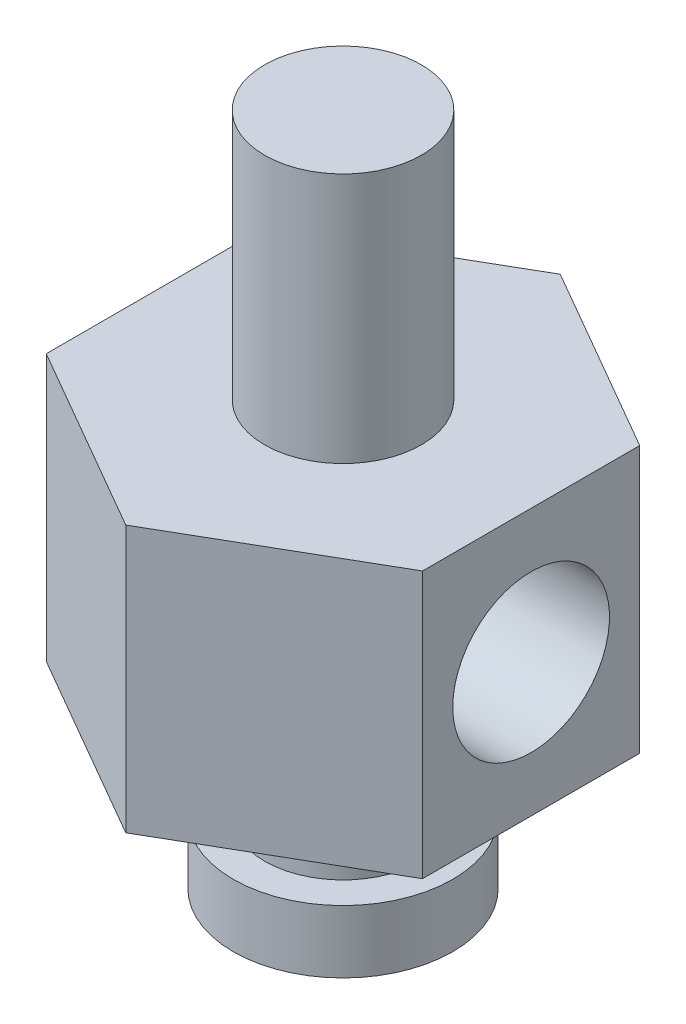
ISO-10303-21;
HEADER;
FILE_DESCRIPTION(('STEP AP214'),'2;1');
FILE_NAME('part.step','',(''),(''),'','','');
FILE_SCHEMA(('AUTOMOTIVE_DESIGN { 1 0 10303 214 1 1 1 1 }'));
ENDSEC;
DATA;
#1=APPLICATION_CONTEXT('core data for automotive mechanical design processes');
#2=APPLICATION_PROTOCOL_DEFINITION('international standard','automotive_design',2000,#1);
#3=PRODUCT_CONTEXT('',#1,'mechanical');
#4=PRODUCT('Part','Part','',(#3));
#5=PRODUCT_RELATED_PRODUCT_CATEGORY('part','',(#4));
#6=PRODUCT_DEFINITION_FORMATION('','',#4);
#7=PRODUCT_DEFINITION_CONTEXT('part definition',#1,'design');
#8=PRODUCT_DEFINITION('design','',#6,#7);
#9=PRODUCT_DEFINITION_SHAPE('','',#8);
#10=(LENGTH_UNIT() NAMED_UNIT(*) SI_UNIT(.MILLI.,.METRE.));
#11=(NAMED_UNIT(*) PLANE_ANGLE_UNIT() SI_UNIT($,.RADIAN.));
#12=(NAMED_UNIT(*) SI_UNIT($,.STERADIAN.) SOLID_ANGLE_UNIT());
#13=UNCERTAINTY_MEASURE_WITH_UNIT(LENGTH_MEASURE(1.E-05),#10,'distance_accuracy_value','');
#14=(GEOMETRIC_REPRESENTATION_CONTEXT(3) GLOBAL_UNCERTAINTY_ASSIGNED_CONTEXT((#13)) GLOBAL_UNIT_ASSIGNED_CONTEXT((#10,
#11,#12)) REPRESENTATION_CONTEXT('',''));
#15=CARTESIAN_POINT('',(0.,0.,0.));
#16=DIRECTION('',(0.,0.,1.));
#17=DIRECTION('',(1.,0.,0.));
#18=AXIS2_PLACEMENT_3D('',#15,#16,#17);
#19=CARTESIAN_POINT('',(0.,2.,0.));
#20=DIRECTION('',(0.,1.,0.));
#21=DIRECTION('',(0.,0.,1.));
#22=AXIS2_PLACEMENT_3D('',#19,#20,#21);
#23=PLANE('',#22);
#24=CARTESIAN_POINT('',(0.,2.,0.));
#25=DIRECTION('',(0.,1.,0.));
#26=DIRECTION('',(0.,0.,1.));
#27=AXIS2_PLACEMENT_3D('',#24,#25,#26);
#28=CIRCLE('',#27,3.5);
#29=CARTESIAN_POINT('',(0.,2.,3.5));
#30=VERTEX_POINT('',#29);
#31=EDGE_CURVE('E11',#30,#30,#28,.T.);
#32=ORIENTED_EDGE('',*,*,#31,.T.);
#33=EDGE_LOOP('',(#32));
#34=FACE_BOUND('',#33,.T.);
#35=CARTESIAN_POINT('',(0.,2.,0.));
#36=DIRECTION('',(0.,1.,0.));
#37=DIRECTION('',(0.,0.,1.));
#38=AXIS2_PLACEMENT_3D('',#35,#36,#37);
#39=CIRCLE('',#38,2.5);
#40=CARTESIAN_POINT('',(0.,2.,2.5));
#41=VERTEX_POINT('',#40);
#42=EDGE_CURVE('E147',#41,#41,#39,.T.);
#43=ORIENTED_EDGE('',*,*,#42,.F.);
#44=EDGE_LOOP('',(#43));
#45=FACE_BOUND('',#44,.T.);
#46=ADVANCED_FACE('F41',(#34,#45),#23,.T.);
#47=CARTESIAN_POINT('',(0.,0.,0.));
#48=DIRECTION('',(0.,1.,0.));
#49=DIRECTION('',(0.,0.,1.));
#50=AXIS2_PLACEMENT_3D('',#47,#48,#49);
#51=PLANE('',#50);
#52=CARTESIAN_POINT('',(0.,0.,0.));
#53=DIRECTION('',(0.,1.,0.));
#54=DIRECTION('',(0.,0.,1.));
#55=AXIS2_PLACEMENT_3D('',#52,#53,#54);
#56=CIRCLE('',#55,3.5);
#57=CARTESIAN_POINT('',(0.,0.,3.5));
#58=VERTEX_POINT('',#57);
#59=EDGE_CURVE('E45',#58,#58,#56,.T.);
#60=ORIENTED_EDGE('',*,*,#59,.F.);
#61=EDGE_LOOP('',(#60));
#62=FACE_BOUND('',#61,.T.);
#63=CARTESIAN_POINT('',(0.,0.,0.));
#64=DIRECTION('',(0.,1.,0.));
#65=DIRECTION('',(0.,0.,1.));
#66=AXIS2_PLACEMENT_3D('',#63,#64,#65);
#67=CIRCLE('',#66,1.5);
#68=CARTESIAN_POINT('',(0.,0.,1.5));
#69=VERTEX_POINT('',#68);
#70=EDGE_CURVE('E151',#69,#69,#67,.T.);
#71=ORIENTED_EDGE('',*,*,#70,.T.);
#72=EDGE_LOOP('',(#71));
#73=FACE_BOUND('',#72,.T.);
#74=ADVANCED_FACE('F161',(#62,#73),#51,.F.);
#75=CARTESIAN_POINT('',(0.,2.,0.));
#76=DIRECTION('',(0.,-1.,0.));
#77=DIRECTION('',(0.,0.,-1.));
#78=AXIS2_PLACEMENT_3D('',#75,#76,#77);
#79=CYLINDRICAL_SURFACE('',#78,3.5);
#80=ORIENTED_EDGE('',*,*,#31,.F.);
#81=EDGE_LOOP('',(#80));
#82=FACE_BOUND('',#81,.T.);
#83=ORIENTED_EDGE('',*,*,#59,.T.);
#84=EDGE_LOOP('',(#83));
#85=FACE_BOUND('',#84,.T.);
#86=ADVANCED_FACE('F43',(#82,#85),#79,.T.);
#87=CARTESIAN_POINT('',(0.,2.,0.));
#88=DIRECTION('',(0.,-1.,0.));
#89=DIRECTION('',(0.,0.,-1.));
#90=AXIS2_PLACEMENT_3D('',#87,#88,#89);
#91=CYLINDRICAL_SURFACE('',#90,1.5);
#92=CARTESIAN_POINT('',(0.,7.25,-1.5));
#93=CARTESIAN_POINT('',(0.0754789752896368,7.25000583357488,-1.50000404108592));
#94=CARTESIAN_POINT('',(0.150938434079796,7.24566366096519,-1.49426852824013));
#95=CARTESIAN_POINT('',(0.299323903962216,7.22907409386117,-1.47174965152787));
#96=CARTESIAN_POINT('',(0.372247187385098,7.21681844956903,-1.45495475788936));
#97=CARTESIAN_POINT('',(0.513083641677278,7.1863766096527,-1.41143486335795));
#98=CARTESIAN_POINT('',(0.581028838035267,7.1682333381688,-1.3847815450315));
#99=CARTESIAN_POINT('',(0.71143745336792,7.12814095004164,-1.32252909283019));
#100=CARTESIAN_POINT('',(0.773899229695138,7.10619069877584,-1.28692729054693));
#101=CARTESIAN_POINT('',(0.899949016664082,7.05771405412458,-1.20271292747644));
#102=CARTESIAN_POINT('',(0.962740957123942,7.03095628962338,-1.15304179435289));
#103=CARTESIAN_POINT('',(1.07976476274175,6.9777377056894,-1.04426801309985));
#104=CARTESIAN_POINT('',(1.1339901516708,6.95127712482897,-0.985158296729612));
#105=CARTESIAN_POINT('',(1.2381338097097,6.89824432141266,-0.851442367411701));
#106=CARTESIAN_POINT('',(1.28695446366975,6.87196866422182,-0.775851995162547));
#107=CARTESIAN_POINT('',(1.37080972244443,6.82556213016821,-0.615654228271658));
#108=CARTESIAN_POINT('',(1.40585697412271,6.80542562011265,-0.53105519662633));
#109=CARTESIAN_POINT('',(1.45759592281265,6.7752901219956,-0.363771406742666));
#110=CARTESIAN_POINT('',(1.4757203609673,6.7645069606083,-0.281674698130915));
#111=CARTESIAN_POINT('',(1.49794280286312,6.75125060722455,-0.114970509382708));
#112=CARTESIAN_POINT('',(1.50205397800005,6.74876961186693,-0.0303654624001531));
#113=CARTESIAN_POINT('',(1.49638625265754,6.75216627288461,0.12763728373731));
#114=CARTESIAN_POINT('',(1.48826647383069,6.75704562486274,0.201123832865635));
#115=CARTESIAN_POINT('',(1.46152020435189,6.77292002446143,0.345464269151768));
#116=CARTESIAN_POINT('',(1.44289293609284,6.78391552470691,0.416317961051202));
#117=CARTESIAN_POINT('',(1.39583443729622,6.81115092798281,0.55405678046908));
#118=CARTESIAN_POINT('',(1.367346938861,6.82742089549176,0.620916491037618));
#119=CARTESIAN_POINT('',(1.30161538377446,6.86390362361252,0.748988660115611));
#120=CARTESIAN_POINT('',(1.26436905294099,6.88411740798188,0.810199646208011));
#121=CARTESIAN_POINT('',(1.17716090719555,6.92962074023638,0.9330742671432));
#122=CARTESIAN_POINT('',(1.12621168826426,6.9552281704785,0.993918663198194));
#123=CARTESIAN_POINT('',(1.01559588213982,7.00744445754399,1.10671465909275));
#124=CARTESIAN_POINT('',(0.955917496525493,7.03405463296625,1.1586540130834));
#125=CARTESIAN_POINT('',(0.821346593836445,7.08888924876055,1.25824837767417));
#126=CARTESIAN_POINT('',(0.745492423460538,7.11694338614876,1.30470933188632));
#127=CARTESIAN_POINT('',(0.585293768363392,7.16749120442733,1.38397217194232));
#128=CARTESIAN_POINT('',(0.500965283874358,7.1899950970118,1.41679921962189));
#129=CARTESIAN_POINT('',(0.347606368104651,7.22104134803269,1.46077497064842));
#130=CARTESIAN_POINT('',(0.279959367703356,7.23166111381684,1.47527903312665));
#131=CARTESIAN_POINT('',(0.142626389700517,7.24607849222442,1.49480872755284));
#132=CARTESIAN_POINT('',(0.0729428795154364,7.24988403884884,1.49984538302907));
#133=CARTESIAN_POINT('',(-0.0665516824357073,7.25011085678677,1.50014781114183));
#134=CARTESIAN_POINT('',(-0.13636277721521,7.24652189776016,1.49540004697659));
#135=CARTESIAN_POINT('',(-0.273987343748558,7.23248479211348,1.47640290574941));
#136=CARTESIAN_POINT('',(-0.341799192240254,7.22203122386787,1.46214601830139));
#137=CARTESIAN_POINT('',(-0.473714579479786,7.195682316669,1.42488312618657));
#138=CARTESIAN_POINT('',(-0.53782263653223,7.17979377907188,1.40188805257362));
#139=CARTESIAN_POINT('',(-0.661477715730181,7.14428460582413,1.34796261057072));
#140=CARTESIAN_POINT('',(-0.721023006366002,7.12466256310001,1.31702924888212));
#141=CARTESIAN_POINT('',(-0.845240082512246,7.07963180822264,1.24167439558512));
#142=CARTESIAN_POINT('',(-0.908900835096568,7.05381760602631,1.19582663060303));
#143=CARTESIAN_POINT('',(-1.02828548484946,7.0017824519638,1.09487395518701));
#144=CARTESIAN_POINT('',(-1.08400169216912,6.97556113288545,1.03976018672402));
#145=CARTESIAN_POINT('',(-1.19322400735043,6.92164374089087,0.913274837212767));
#146=CARTESIAN_POINT('',(-1.24550072660584,6.8941992412413,0.840721108780192));
#147=CARTESIAN_POINT('',(-1.33690277683665,6.84462360866542,0.686103100868021));
#148=CARTESIAN_POINT('',(-1.37603682784092,6.8224889555059,0.604045176134703));
#149=CARTESIAN_POINT('',(-1.43686820343137,6.78747719907225,0.438840232972139));
#150=CARTESIAN_POINT('',(-1.45962622779111,6.77404411932671,0.356205963651259));
#151=CARTESIAN_POINT('',(-1.49071460284626,6.755592610939,0.187383063890858));
#152=CARTESIAN_POINT('',(-1.49906129071762,6.75056465417263,0.10119857178197));
#153=CARTESIAN_POINT('',(-1.50067460858593,6.74959399538024,-0.059812023200983));
#154=CARTESIAN_POINT('',(-1.49580333456303,6.75252942813673,-0.134620583589705));
#155=CARTESIAN_POINT('',(-1.47510617561839,6.76487051587905,-0.282148755978773));
#156=CARTESIAN_POINT('',(-1.4592801686784,6.77427624293361,-0.354868344701913));
#157=CARTESIAN_POINT('',(-1.41778042841622,6.79850572473038,-0.495145481978796));
#158=CARTESIAN_POINT('',(-1.39226840387076,6.81324033141094,-0.562767032608829));
#159=CARTESIAN_POINT('',(-1.33235940544525,6.84696662552845,-0.692781971999983));
#160=CARTESIAN_POINT('',(-1.2979604391404,6.86595926747732,-0.755174184199832));
#161=CARTESIAN_POINT('',(-1.21707480343124,6.90906567340619,-0.880263645295947));
#162=CARTESIAN_POINT('',(-1.16968129098313,6.93351155360851,-0.942258690439939));
#163=CARTESIAN_POINT('',(-1.06624696628228,6.98398092649339,-1.05789751536306));
#164=CARTESIAN_POINT('',(-1.01019657439209,7.01000614725491,-1.11153190956916));
#165=CARTESIAN_POINT('',(-0.882714437822303,7.06471834333795,-1.2159097535057));
#166=CARTESIAN_POINT('',(-0.810233513834503,7.09332433729099,-1.26542406663367));
#167=CARTESIAN_POINT('',(-0.656515147233461,7.14623535514855,-1.35156817210325));
#168=CARTESIAN_POINT('',(-0.575282286018587,7.17054261188948,-1.38820466322661));
#169=CARTESIAN_POINT('',(-0.412935714862799,7.2091999695204,-1.44437116535132));
#170=CARTESIAN_POINT('',(-0.332404764038755,7.22422334169862,-1.46509526060187));
#171=CARTESIAN_POINT('',(-0.167902605296321,7.24460967679964,-1.49289268240426));
#172=CARTESIAN_POINT('',(-0.0839392342412885,7.24999351255357,-1.49999550595837));
#173=CARTESIAN_POINT('',(0.,7.25,-1.5));
#174=B_SPLINE_CURVE_WITH_KNOTS('',3,(#92,#93,#94,#95,#96,#97,#98,#99,#100,#101,#102,#103,#104,
#105,#106,#107,#108,#109,#110,#111,#112,#113,#114,#115,#116,#117,#118,#119,#120,#121,#122,#123,
#124,#125,#126,#127,#128,#129,#130,#131,#132,#133,#134,#135,#136,#137,#138,#139,#140,#141,#142,
#143,#144,#145,#146,#147,#148,#149,#150,#151,#152,#153,#154,#155,#156,#157,#158,#159,#160,#161,
#162,#163,#164,#165,#166,#167,#168,#169,#170,#171,#172,#173),.UNSPECIFIED.,.T.,.F.,(4,2,2,2,2,2,
2,2,2,2,2,2,2,2,2,2,2,2,2,2,2,2,2,2,2,2,2,2,2,2,2,2,2,2,2,2,2,2,2,2,4),(0.,0.226085249493392,
0.45240657433077,0.677113624991876,0.901887762215933,1.15414462390001,1.40659128601844,
1.68630157736223,1.9657544327122,2.21853330858497,2.47107452602766,2.69230130543182,
2.91354445887944,3.13607155036377,3.35865648368878,3.60782810055849,3.85733966656908,
4.13576671140276,4.41367760154768,4.62276298054684,4.83160475643976,5.04073566011181,
5.25003193304128,5.45906724365495,5.6681814915466,5.91499438482002,6.16204457978454,
6.44121828011588,6.72020638384847,6.97891479383337,7.23732973022726,7.46129321849399,
7.68525920139648,7.90563970188756,8.12606965394584,8.37042963549487,8.61506198741954,
8.89071695766603,9.16622832484805,9.41820120134354,9.66962780912277),.UNSPECIFIED.);
#175=CARTESIAN_POINT('',(0.,7.25,-1.5));
#176=VERTEX_POINT('',#175);
#177=EDGE_CURVE('E181',#176,#176,#174,.T.);
#178=ORIENTED_EDGE('',*,*,#177,.F.);
#179=EDGE_LOOP('',(#178));
#180=FACE_BOUND('',#179,.T.);
#181=ORIENTED_EDGE('',*,*,#70,.F.);
#182=EDGE_LOOP('',(#181));
#183=FACE_BOUND('',#182,.T.);
#184=ADVANCED_FACE('F166',(#180,#183),#91,.F.);
#185=CARTESIAN_POINT('',(0.,5.,0.));
#186=DIRECTION('',(0.,-1.,0.));
#187=DIRECTION('',(0.,0.,-1.));
#188=AXIS2_PLACEMENT_3D('',#185,#186,#187);
#189=CYLINDRICAL_SURFACE('',#188,2.5);
#190=CARTESIAN_POINT('',(0.,5.,0.));
#191=DIRECTION('',(0.,1.,0.));
#192=DIRECTION('',(0.,0.,1.));
#193=AXIS2_PLACEMENT_3D('',#190,#191,#192);
#194=CIRCLE('',#193,2.5);
#195=CARTESIAN_POINT('',(0.,5.,2.5));
#196=VERTEX_POINT('',#195);
#197=EDGE_CURVE('E148',#196,#196,#194,.T.);
#198=ORIENTED_EDGE('',*,*,#197,.F.);
#199=EDGE_LOOP('',(#198));
#200=FACE_BOUND('',#199,.T.);
#201=ORIENTED_EDGE('',*,*,#42,.T.);
#202=EDGE_LOOP('',(#201));
#203=FACE_BOUND('',#202,.T.);
#204=ADVANCED_FACE('F175',(#200,#203),#189,.T.);
#205=CARTESIAN_POINT('',(0.,13.5,0.));
#206=DIRECTION('',(0.,1.,0.));
#207=DIRECTION('',(0.,0.,1.));
#208=AXIS2_PLACEMENT_3D('',#205,#206,#207);
#209=PLANE('',#208);
#210=CARTESIAN_POINT('',(0.,13.5,0.));
#211=DIRECTION('',(0.,1.,0.));
#212=DIRECTION('',(0.,0.,1.));
#213=AXIS2_PLACEMENT_3D('',#210,#211,#212);
#214=CIRCLE('',#213,2.5);
#215=CARTESIAN_POINT('',(0.,13.5,2.5));
#216=VERTEX_POINT('',#215);
#217=EDGE_CURVE('E194',#216,#216,#214,.T.);
#218=ORIENTED_EDGE('',*,*,#217,.F.);
#219=EDGE_LOOP('',(#218));
#220=FACE_BOUND('',#219,.T.);
#221=DIRECTION('',(-0.866025403784439,0.,0.5));
#222=VECTOR('',#221,1.);
#223=CARTESIAN_POINT('',(0.,13.5,-6.92820323027551));
#224=LINE('',#223,#222);
#225=CARTESIAN_POINT('',(0.,13.5,-6.92820323027551));
#226=VERTEX_POINT('',#225);
#227=CARTESIAN_POINT('',(-6.,13.5,-3.46410161513775));
#228=VERTEX_POINT('',#227);
#229=EDGE_CURVE('E138',#226,#228,#224,.T.);
#230=ORIENTED_EDGE('',*,*,#229,.T.);
#231=DIRECTION('',(0.,0.,1.));
#232=VECTOR('',#231,1.);
#233=CARTESIAN_POINT('',(-6.,13.5,-3.46410161513775));
#234=LINE('',#233,#232);
#235=CARTESIAN_POINT('',(-6.,13.5,3.46410161513775));
#236=VERTEX_POINT('',#235);
#237=EDGE_CURVE('E96',#228,#236,#234,.T.);
#238=ORIENTED_EDGE('',*,*,#237,.T.);
#239=DIRECTION('',(0.866025403784439,0.,0.5));
#240=VECTOR('',#239,1.);
#241=CARTESIAN_POINT('',(-6.,13.5,3.46410161513775));
#242=LINE('',#241,#240);
#243=CARTESIAN_POINT('',(0.,13.5,6.92820323027551));
#244=VERTEX_POINT('',#243);
#245=EDGE_CURVE('E109',#236,#244,#242,.T.);
#246=ORIENTED_EDGE('',*,*,#245,.T.);
#247=DIRECTION('',(0.866025403784439,0.,-0.5));
#248=VECTOR('',#247,1.);
#249=CARTESIAN_POINT('',(0.,13.5,6.92820323027551));
#250=LINE('',#249,#248);
#251=CARTESIAN_POINT('',(6.,13.5,3.46410161513775));
#252=VERTEX_POINT('',#251);
#253=EDGE_CURVE('E103',#244,#252,#250,.T.);
#254=ORIENTED_EDGE('',*,*,#253,.T.);
#255=DIRECTION('',(0.,0.,-1.));
#256=VECTOR('',#255,1.);
#257=CARTESIAN_POINT('',(6.,13.5,3.46410161513775));
#258=LINE('',#257,#256);
#259=CARTESIAN_POINT('',(6.,13.5,-3.46410161513775));
#260=VERTEX_POINT('',#259);
#261=EDGE_CURVE('E107',#252,#260,#258,.T.);
#262=ORIENTED_EDGE('',*,*,#261,.T.);
#263=DIRECTION('',(-0.866025403784439,0.,-0.5));
#264=VECTOR('',#263,1.);
#265=CARTESIAN_POINT('',(6.,13.5,-3.46410161513775));
#266=LINE('',#265,#264);
#267=EDGE_CURVE('E58',#260,#226,#266,.T.);
#268=ORIENTED_EDGE('',*,*,#267,.T.);
#269=EDGE_LOOP('',(#230,#238,#246,#254,#262,#268));
#270=FACE_BOUND('',#269,.T.);
#271=ADVANCED_FACE('F105',(#220,#270),#209,.T.);
#272=CARTESIAN_POINT('',(0.,5.,0.));
#273=DIRECTION('',(0.,1.,0.));
#274=DIRECTION('',(0.,0.,1.));
#275=AXIS2_PLACEMENT_3D('',#272,#273,#274);
#276=PLANE('',#275);
#277=ORIENTED_EDGE('',*,*,#197,.T.);
#278=EDGE_LOOP('',(#277));
#279=FACE_BOUND('',#278,.T.);
#280=DIRECTION('',(-0.866025403784439,0.,0.5));
#281=VECTOR('',#280,1.);
#282=CARTESIAN_POINT('',(0.,5.,-6.92820323027551));
#283=LINE('',#282,#281);
#284=CARTESIAN_POINT('',(0.,5.,-6.92820323027551));
#285=VERTEX_POINT('',#284);
#286=CARTESIAN_POINT('',(-6.,5.,-3.46410161513775));
#287=VERTEX_POINT('',#286);
#288=EDGE_CURVE('E127',#285,#287,#283,.T.);
#289=ORIENTED_EDGE('',*,*,#288,.F.);
#290=DIRECTION('',(-0.866025403784439,0.,-0.5));
#291=VECTOR('',#290,1.);
#292=CARTESIAN_POINT('',(6.,5.,-3.46410161513775));
#293=LINE('',#292,#291);
#294=CARTESIAN_POINT('',(6.,5.,-3.46410161513775));
#295=VERTEX_POINT('',#294);
#296=EDGE_CURVE('E87',#295,#285,#293,.T.);
#297=ORIENTED_EDGE('',*,*,#296,.F.);
#298=DIRECTION('',(0.,0.,-1.));
#299=VECTOR('',#298,1.);
#300=CARTESIAN_POINT('',(6.,5.,3.46410161513775));
#301=LINE('',#300,#299);
#302=CARTESIAN_POINT('',(6.,5.,3.46410161513775));
#303=VERTEX_POINT('',#302);
#304=EDGE_CURVE('E81',#303,#295,#301,.T.);
#305=ORIENTED_EDGE('',*,*,#304,.F.);
#306=DIRECTION('',(0.866025403784439,0.,-0.5));
#307=VECTOR('',#306,1.);
#308=CARTESIAN_POINT('',(0.,5.,6.92820323027551));
#309=LINE('',#308,#307);
#310=CARTESIAN_POINT('',(0.,5.,6.92820323027551));
#311=VERTEX_POINT('',#310);
#312=EDGE_CURVE('E117',#311,#303,#309,.T.);
#313=ORIENTED_EDGE('',*,*,#312,.F.);
#314=DIRECTION('',(0.866025403784439,0.,0.5));
#315=VECTOR('',#314,1.);
#316=CARTESIAN_POINT('',(-6.,5.,3.46410161513775));
#317=LINE('',#316,#315);
#318=CARTESIAN_POINT('',(-6.,5.,3.46410161513775));
#319=VERTEX_POINT('',#318);
#320=EDGE_CURVE('E133',#319,#311,#317,.T.);
#321=ORIENTED_EDGE('',*,*,#320,.F.);
#322=DIRECTION('',(0.,0.,1.));
#323=VECTOR('',#322,1.);
#324=CARTESIAN_POINT('',(-6.,5.,-3.46410161513775));
#325=LINE('',#324,#323);
#326=EDGE_CURVE('E130',#287,#319,#325,.T.);
#327=ORIENTED_EDGE('',*,*,#326,.F.);
#328=EDGE_LOOP('',(#289,#297,#305,#313,#321,#327));
#329=FACE_BOUND('',#328,.T.);
#330=ADVANCED_FACE('F218',(#279,#329),#276,.F.);
#331=CARTESIAN_POINT('',(0.,13.5,-6.92820323027551));
#332=DIRECTION('',(0.5,0.,0.866025403784439));
#333=DIRECTION('',(0.866025403784439,0.,-0.5));
#334=AXIS2_PLACEMENT_3D('',#331,#332,#333);
#335=PLANE('',#334);
#336=ORIENTED_EDGE('',*,*,#288,.T.);
#337=DIRECTION('',(0.,-1.,0.));
#338=VECTOR('',#337,1.);
#339=CARTESIAN_POINT('',(-6.,13.5,-3.46410161513775));
#340=LINE('',#339,#338);
#341=EDGE_CURVE('E145',#228,#287,#340,.T.);
#342=ORIENTED_EDGE('',*,*,#341,.F.);
#343=ORIENTED_EDGE('',*,*,#229,.F.);
#344=DIRECTION('',(0.,-1.,0.));
#345=VECTOR('',#344,1.);
#346=CARTESIAN_POINT('',(0.,13.5,-6.92820323027551));
#347=LINE('',#346,#345);
#348=EDGE_CURVE('E123',#226,#285,#347,.T.);
#349=ORIENTED_EDGE('',*,*,#348,.T.);
#350=EDGE_LOOP('',(#336,#342,#343,#349));
#351=FACE_BOUND('',#350,.T.);
#352=ADVANCED_FACE('F222',(#351),#335,.F.);
#353=CARTESIAN_POINT('',(-6.,13.5,-3.46410161513775));
#354=DIRECTION('',(1.,0.,0.));
#355=DIRECTION('',(0.,0.,-1.));
#356=AXIS2_PLACEMENT_3D('',#353,#354,#355);
#357=PLANE('',#356);
#358=CARTESIAN_POINT('',(-6.,9.25,0.));
#359=DIRECTION('',(-1.,0.,0.));
#360=DIRECTION('',(0.,0.,1.));
#361=AXIS2_PLACEMENT_3D('',#358,#359,#360);
#362=CIRCLE('',#361,2.5);
#363=CARTESIAN_POINT('',(-6.,9.25,2.5));
#364=VERTEX_POINT('',#363);
#365=EDGE_CURVE('E273',#364,#364,#362,.T.);
#366=ORIENTED_EDGE('',*,*,#365,.F.);
#367=EDGE_LOOP('',(#366));
#368=FACE_BOUND('',#367,.T.);
#369=ORIENTED_EDGE('',*,*,#326,.T.);
#370=DIRECTION('',(0.,-1.,0.));
#371=VECTOR('',#370,1.);
#372=CARTESIAN_POINT('',(-6.,13.5,3.46410161513775));
#373=LINE('',#372,#371);
#374=EDGE_CURVE('E142',#236,#319,#373,.T.);
#375=ORIENTED_EDGE('',*,*,#374,.F.);
#376=ORIENTED_EDGE('',*,*,#237,.F.);
#377=ORIENTED_EDGE('',*,*,#341,.T.);
#378=EDGE_LOOP('',(#369,#375,#376,#377));
#379=FACE_BOUND('',#378,.T.);
#380=ADVANCED_FACE('F234',(#368,#379),#357,.F.);
#381=CARTESIAN_POINT('',(-6.,13.5,3.46410161513775));
#382=DIRECTION('',(0.5,0.,-0.866025403784439));
#383=DIRECTION('',(-0.866025403784439,0.,-0.5));
#384=AXIS2_PLACEMENT_3D('',#381,#382,#383);
#385=PLANE('',#384);
#386=ORIENTED_EDGE('',*,*,#320,.T.);
#387=DIRECTION('',(0.,-1.,0.));
#388=VECTOR('',#387,1.);
#389=CARTESIAN_POINT('',(0.,13.5,6.92820323027551));
#390=LINE('',#389,#388);
#391=EDGE_CURVE('E118',#244,#311,#390,.T.);
#392=ORIENTED_EDGE('',*,*,#391,.F.);
#393=ORIENTED_EDGE('',*,*,#245,.F.);
#394=ORIENTED_EDGE('',*,*,#374,.T.);
#395=EDGE_LOOP('',(#386,#392,#393,#394));
#396=FACE_BOUND('',#395,.T.);
#397=ADVANCED_FACE('F231',(#396),#385,.F.);
#398=CARTESIAN_POINT('',(0.,13.5,6.92820323027551));
#399=DIRECTION('',(-0.5,0.,-0.866025403784439));
#400=DIRECTION('',(-0.866025403784439,0.,0.5));
#401=AXIS2_PLACEMENT_3D('',#398,#399,#400);
#402=PLANE('',#401);
#403=ORIENTED_EDGE('',*,*,#312,.T.);
#404=DIRECTION('',(0.,-1.,0.));
#405=VECTOR('',#404,1.);
#406=CARTESIAN_POINT('',(6.,13.5,3.46410161513775));
#407=LINE('',#406,#405);
#408=EDGE_CURVE('E114',#252,#303,#407,.T.);
#409=ORIENTED_EDGE('',*,*,#408,.F.);
#410=ORIENTED_EDGE('',*,*,#253,.F.);
#411=ORIENTED_EDGE('',*,*,#391,.T.);
#412=EDGE_LOOP('',(#403,#409,#410,#411));
#413=FACE_BOUND('',#412,.T.);
#414=ADVANCED_FACE('F115',(#413),#402,.F.);
#415=CARTESIAN_POINT('',(6.,13.5,3.46410161513775));
#416=DIRECTION('',(-1.,0.,0.));
#417=DIRECTION('',(0.,0.,1.));
#418=AXIS2_PLACEMENT_3D('',#415,#416,#417);
#419=PLANE('',#418);
#420=CARTESIAN_POINT('',(6.,9.25,0.));
#421=DIRECTION('',(-1.,0.,0.));
#422=DIRECTION('',(0.,0.,1.));
#423=AXIS2_PLACEMENT_3D('',#420,#421,#422);
#424=CIRCLE('',#423,2.5);
#425=CARTESIAN_POINT('',(6.,9.25,2.5));
#426=VERTEX_POINT('',#425);
#427=EDGE_CURVE('E270',#426,#426,#424,.F.);
#428=ORIENTED_EDGE('',*,*,#427,.F.);
#429=EDGE_LOOP('',(#428));
#430=FACE_BOUND('',#429,.T.);
#431=ORIENTED_EDGE('',*,*,#304,.T.);
#432=DIRECTION('',(0.,-1.,0.));
#433=VECTOR('',#432,1.);
#434=CARTESIAN_POINT('',(6.,13.5,-3.46410161513775));
#435=LINE('',#434,#433);
#436=EDGE_CURVE('E119',#260,#295,#435,.T.);
#437=ORIENTED_EDGE('',*,*,#436,.F.);
#438=ORIENTED_EDGE('',*,*,#261,.F.);
#439=ORIENTED_EDGE('',*,*,#408,.T.);
#440=EDGE_LOOP('',(#431,#437,#438,#439));
#441=FACE_BOUND('',#440,.T.);
#442=ADVANCED_FACE('F121',(#430,#441),#419,.F.);
#443=CARTESIAN_POINT('',(6.,13.5,-3.46410161513775));
#444=DIRECTION('',(-0.5,0.,0.866025403784439));
#445=DIRECTION('',(0.866025403784439,0.,0.5));
#446=AXIS2_PLACEMENT_3D('',#443,#444,#445);
#447=PLANE('',#446);
#448=ORIENTED_EDGE('',*,*,#296,.T.);
#449=ORIENTED_EDGE('',*,*,#348,.F.);
#450=ORIENTED_EDGE('',*,*,#267,.F.);
#451=ORIENTED_EDGE('',*,*,#436,.T.);
#452=EDGE_LOOP('',(#448,#449,#450,#451));
#453=FACE_BOUND('',#452,.T.);
#454=ADVANCED_FACE('F208',(#453),#447,.F.);
#455=CARTESIAN_POINT('',(0.,21.5,0.));
#456=DIRECTION('',(0.,1.,0.));
#457=DIRECTION('',(0.,0.,1.));
#458=AXIS2_PLACEMENT_3D('',#455,#456,#457);
#459=PLANE('',#458);
#460=CARTESIAN_POINT('',(0.,21.5,0.));
#461=DIRECTION('',(0.,1.,0.));
#462=DIRECTION('',(0.,0.,1.));
#463=AXIS2_PLACEMENT_3D('',#460,#461,#462);
#464=CIRCLE('',#463,2.5);
#465=CARTESIAN_POINT('',(0.,21.5,2.5));
#466=VERTEX_POINT('',#465);
#467=EDGE_CURVE('E195',#466,#466,#464,.T.);
#468=ORIENTED_EDGE('',*,*,#467,.T.);
#469=EDGE_LOOP('',(#468));
#470=FACE_BOUND('',#469,.T.);
#471=ADVANCED_FACE('F204',(#470),#459,.T.);
#472=CARTESIAN_POINT('',(0.,21.5,0.));
#473=DIRECTION('',(0.,-1.,0.));
#474=DIRECTION('',(0.,0.,-1.));
#475=AXIS2_PLACEMENT_3D('',#472,#473,#474);
#476=CYLINDRICAL_SURFACE('',#475,2.5);
#477=ORIENTED_EDGE('',*,*,#467,.F.);
#478=EDGE_LOOP('',(#477));
#479=FACE_BOUND('',#478,.T.);
#480=ORIENTED_EDGE('',*,*,#217,.T.);
#481=EDGE_LOOP('',(#480));
#482=FACE_BOUND('',#481,.T.);
#483=ADVANCED_FACE('F202',(#479,#482),#476,.T.);
#484=CARTESIAN_POINT('',(13.0710678118655,9.25,0.));
#485=DIRECTION('',(-1.,0.,0.));
#486=DIRECTION('',(0.,0.,1.));
#487=AXIS2_PLACEMENT_3D('',#484,#485,#486);
#488=CYLINDRICAL_SURFACE('',#487,2.5);
#489=CARTESIAN_POINT('',(0.,11.25,-1.5));
#490=CARTESIAN_POINT('',(-0.0754789752896367,11.2499941664251,-1.50000404108592));
#491=CARTESIAN_POINT('',(-0.150938434079796,11.2543363390348,-1.49426852824013));
#492=CARTESIAN_POINT('',(-0.299323903962216,11.2709259061388,-1.47174965152787));
#493=CARTESIAN_POINT('',(-0.372247187385098,11.283181550431,-1.45495475788936));
#494=CARTESIAN_POINT('',(-0.513083641677278,11.3136233903473,-1.41143486335795));
#495=CARTESIAN_POINT('',(-0.581028838035267,11.3317666618312,-1.3847815450315));
#496=CARTESIAN_POINT('',(-0.71143745336792,11.3718590499584,-1.32252909283019));
#497=CARTESIAN_POINT('',(-0.773899229695138,11.3938093012242,-1.28692729054693));
#498=CARTESIAN_POINT('',(-0.899949016664082,11.4422859458754,-1.20271292747644));
#499=CARTESIAN_POINT('',(-0.962740957123942,11.4690437103766,-1.15304179435289));
#500=CARTESIAN_POINT('',(-1.07976476274175,11.5222622943106,-1.04426801309985));
#501=CARTESIAN_POINT('',(-1.1339901516708,11.548722875171,-0.985158296729613));
#502=CARTESIAN_POINT('',(-1.2381338097097,11.6017556785873,-0.851442367411701));
#503=CARTESIAN_POINT('',(-1.28695446366975,11.6280313357782,-0.775851995162548));
#504=CARTESIAN_POINT('',(-1.37080972244443,11.6744378698318,-0.615654228271658));
#505=CARTESIAN_POINT('',(-1.40585697412271,11.6945743798874,-0.53105519662633));
#506=CARTESIAN_POINT('',(-1.45759592281265,11.7247098780044,-0.363771406742666));
#507=CARTESIAN_POINT('',(-1.4757203609673,11.7354930393917,-0.281674698130915));
#508=CARTESIAN_POINT('',(-1.49794280286312,11.7487493927755,-0.114970509382707));
#509=CARTESIAN_POINT('',(-1.50205397800005,11.7512303881331,-0.0303654624001527));
#510=CARTESIAN_POINT('',(-1.49638625265754,11.7478337271154,0.127637283737311));
#511=CARTESIAN_POINT('',(-1.48826647383069,11.7429543751373,0.201123832865636));
#512=CARTESIAN_POINT('',(-1.46152020435189,11.7270799755386,0.345464269151769));
#513=CARTESIAN_POINT('',(-1.44289293609284,11.7160844752931,0.416317961051202));
#514=CARTESIAN_POINT('',(-1.39583443729622,11.6888490720172,0.55405678046908));
#515=CARTESIAN_POINT('',(-1.367346938861,11.6725791045082,0.620916491037619));
#516=CARTESIAN_POINT('',(-1.30161538377446,11.6360963763875,0.748988660115612));
#517=CARTESIAN_POINT('',(-1.26436905294099,11.6158825920181,0.810199646208012));
#518=CARTESIAN_POINT('',(-1.17716090719555,11.5703792597636,0.9330742671432));
#519=CARTESIAN_POINT('',(-1.12621168826426,11.5447718295215,0.993918663198194));
#520=CARTESIAN_POINT('',(-1.01559588213982,11.492555542456,1.10671465909275));
#521=CARTESIAN_POINT('',(-0.955917496525493,11.4659453670338,1.1586540130834));
#522=CARTESIAN_POINT('',(-0.821346593836446,11.4111107512395,1.25824837767417));
#523=CARTESIAN_POINT('',(-0.745492423460538,11.3830566138512,1.30470933188632));
#524=CARTESIAN_POINT('',(-0.585293768363392,11.3325087955727,1.38397217194232));
#525=CARTESIAN_POINT('',(-0.500965283874357,11.3100049029882,1.41679921962189));
#526=CARTESIAN_POINT('',(-0.347606368104651,11.2789586519673,1.46077497064843));
#527=CARTESIAN_POINT('',(-0.279959367703356,11.2683388861832,1.47527903312665));
#528=CARTESIAN_POINT('',(-0.142626389700517,11.2539215077756,1.49480872755284));
#529=CARTESIAN_POINT('',(-0.0729428795154363,11.2501159611512,1.49984538302907));
#530=CARTESIAN_POINT('',(0.0665516824357074,11.2498891432132,1.50014781114183));
#531=CARTESIAN_POINT('',(0.13636277721521,11.2534781022398,1.49540004697659));
#532=CARTESIAN_POINT('',(0.273987343748558,11.2675152078865,1.47640290574941));
#533=CARTESIAN_POINT('',(0.341799192240254,11.2779687761321,1.46214601830139));
#534=CARTESIAN_POINT('',(0.473714579479786,11.304317683331,1.42488312618657));
#535=CARTESIAN_POINT('',(0.53782263653223,11.3202062209281,1.40188805257362));
#536=CARTESIAN_POINT('',(0.661477715730181,11.3557153941759,1.34796261057072));
#537=CARTESIAN_POINT('',(0.721023006366002,11.3753374369,1.31702924888212));
#538=CARTESIAN_POINT('',(0.845240082512246,11.4203681917774,1.24167439558512));
#539=CARTESIAN_POINT('',(0.908900835096568,11.4461823939737,1.19582663060303));
#540=CARTESIAN_POINT('',(1.02828548484946,11.4982175480362,1.09487395518701));
#541=CARTESIAN_POINT('',(1.08400169216912,11.5244388671145,1.03976018672402));
#542=CARTESIAN_POINT('',(1.19322400735043,11.5783562591091,0.913274837212767));
#543=CARTESIAN_POINT('',(1.24550072660584,11.6058007587587,0.840721108780192));
#544=CARTESIAN_POINT('',(1.33690277683665,11.6553763913346,0.68610310086802));
#545=CARTESIAN_POINT('',(1.37603682784092,11.6775110444941,0.604045176134703));
#546=CARTESIAN_POINT('',(1.43686820343137,11.7125228009278,0.438840232972139));
#547=CARTESIAN_POINT('',(1.45962622779111,11.7259558806733,0.356205963651259));
#548=CARTESIAN_POINT('',(1.49071460284626,11.744407389061,0.187383063890858));
#549=CARTESIAN_POINT('',(1.49906129071762,11.7494353458274,0.10119857178197));
#550=CARTESIAN_POINT('',(1.50067460858593,11.7504060046198,-0.0598120232009826));
#551=CARTESIAN_POINT('',(1.49580333456303,11.7474705718633,-0.134620583589705));
#552=CARTESIAN_POINT('',(1.47510617561839,11.735129484121,-0.282148755978772));
#553=CARTESIAN_POINT('',(1.4592801686784,11.7257237570664,-0.354868344701913));
#554=CARTESIAN_POINT('',(1.41778042841622,11.7014942752696,-0.495145481978796));
#555=CARTESIAN_POINT('',(1.39226840387076,11.6867596685891,-0.562767032608829));
#556=CARTESIAN_POINT('',(1.33235940544525,11.6530333744716,-0.692781971999983));
#557=CARTESIAN_POINT('',(1.2979604391404,11.6340407325227,-0.755174184199831));
#558=CARTESIAN_POINT('',(1.21707480343124,11.5909343265938,-0.880263645295946));
#559=CARTESIAN_POINT('',(1.16968129098313,11.5664884463915,-0.942258690439939));
#560=CARTESIAN_POINT('',(1.06624696628228,11.5160190735066,-1.05789751536307));
#561=CARTESIAN_POINT('',(1.01019657439209,11.4899938527451,-1.11153190956916));
#562=CARTESIAN_POINT('',(0.882714437822302,11.435281656662,-1.2159097535057));
#563=CARTESIAN_POINT('',(0.810233513834502,11.406675662709,-1.26542406663367));
#564=CARTESIAN_POINT('',(0.65651514723346,11.3537646448515,-1.35156817210325));
#565=CARTESIAN_POINT('',(0.575282286018586,11.3294573881105,-1.38820466322661));
#566=CARTESIAN_POINT('',(0.412935714862798,11.2908000304796,-1.44437116535132));
#567=CARTESIAN_POINT('',(0.332404764038754,11.2757766583014,-1.46509526060187));
#568=CARTESIAN_POINT('',(0.16790260529632,11.2553903232004,-1.49289268240426));
#569=CARTESIAN_POINT('',(0.083939234241288,11.2500064874464,-1.49999550595837));
#570=CARTESIAN_POINT('',(0.,11.25,-1.5));
#571=B_SPLINE_CURVE_WITH_KNOTS('',3,(#489,#490,#491,#492,#493,#494,#495,#496,#497,#498,#499,
#500,#501,#502,#503,#504,#505,#506,#507,#508,#509,#510,#511,#512,#513,#514,#515,#516,#517,#518,
#519,#520,#521,#522,#523,#524,#525,#526,#527,#528,#529,#530,#531,#532,#533,#534,#535,#536,#537,
#538,#539,#540,#541,#542,#543,#544,#545,#546,#547,#548,#549,#550,#551,#552,#553,#554,#555,#556,
#557,#558,#559,#560,#561,#562,#563,#564,#565,#566,#567,#568,#569,#570),.UNSPECIFIED.,.T.,.F.,(4,
2,2,2,2,2,2,2,2,2,2,2,2,2,2,2,2,2,2,2,2,2,2,2,2,2,2,2,2,2,2,2,2,2,2,2,2,2,2,2,4),(0.,
0.226085249493392,0.45240657433077,0.677113624991876,0.901887762215933,1.15414462390001,
1.40659128601844,1.68630157736223,1.9657544327122,2.21853330858497,2.47107452602767,
2.69230130543182,2.91354445887945,3.13607155036377,3.35865648368878,3.60782810055849,
3.85733966656908,4.13576671140276,4.41367760154768,4.62276298054684,4.83160475643976,
5.04073566011181,5.25003193304128,5.45906724365495,5.66818149154661,5.91499438482002,
6.16204457978454,6.44121828011588,6.72020638384847,6.97891479383337,7.23732973022726,
7.46129321849399,7.68525920139648,7.90563970188756,8.12606965394584,8.37042963549487,
8.61506198741954,8.89071695766604,9.16622832484805,9.41820120134354,9.66962780912277),.UNSPECIFIED.);
#572=CARTESIAN_POINT('',(0.,11.25,-1.5));
#573=VERTEX_POINT('',#572);
#574=EDGE_CURVE('E188',#573,#573,#571,.T.);
#575=ORIENTED_EDGE('',*,*,#574,.T.);
#576=EDGE_LOOP('',(#575));
#577=FACE_BOUND('',#576,.T.);
#578=ORIENTED_EDGE('',*,*,#177,.T.);
#579=EDGE_LOOP('',(#578));
#580=FACE_BOUND('',#579,.T.);
#581=ORIENTED_EDGE('',*,*,#427,.T.);
#582=EDGE_LOOP('',(#581));
#583=FACE_BOUND('',#582,.T.);
#584=ORIENTED_EDGE('',*,*,#365,.T.);
#585=EDGE_LOOP('',(#584));
#586=FACE_BOUND('',#585,.T.);
#587=ADVANCED_FACE('F197',(#577,#580,#583,#586),#488,.F.);
#588=CARTESIAN_POINT('',(0.,13.5,0.));
#589=DIRECTION('',(0.,1.,0.));
#590=DIRECTION('',(0.,0.,1.));
#591=AXIS2_PLACEMENT_3D('',#588,#589,#590);
#592=PLANE('',#591);
#593=CARTESIAN_POINT('',(0.,13.5,0.));
#594=DIRECTION('',(0.,1.,0.));
#595=DIRECTION('',(0.,0.,1.));
#596=AXIS2_PLACEMENT_3D('',#593,#594,#595);
#597=CIRCLE('',#596,1.5);
#598=CARTESIAN_POINT('',(0.,13.5,1.5));
#599=VERTEX_POINT('',#598);
#600=EDGE_CURVE('E131',#599,#599,#597,.T.);
#601=ORIENTED_EDGE('',*,*,#600,.F.);
#602=EDGE_LOOP('',(#601));
#603=FACE_BOUND('',#602,.T.);
#604=ADVANCED_FACE('F201',(#603),#592,.F.);
#605=ORIENTED_EDGE('',*,*,#574,.F.);
#606=EDGE_LOOP('',(#605));
#607=FACE_BOUND('',#606,.T.);
#608=ORIENTED_EDGE('',*,*,#600,.T.);
#609=EDGE_LOOP('',(#608));
#610=FACE_BOUND('',#609,.T.);
#611=ADVANCED_FACE('F177',(#607,#610),#91,.F.);
#612=CLOSED_SHELL('',(#46,#74,#86,#184,#204,#271,#330,#352,#380,#397,#414,#442,#454,#471,#483,
#587,#604,#611));
#613=MANIFOLD_SOLID_BREP('B2',#612);
#614=ADVANCED_BREP_SHAPE_REPRESENTATION('',(#18,#613),#14);
#615=SHAPE_DEFINITION_REPRESENTATION(#9,#614);
ENDSEC;
END-ISO-10303-21;
